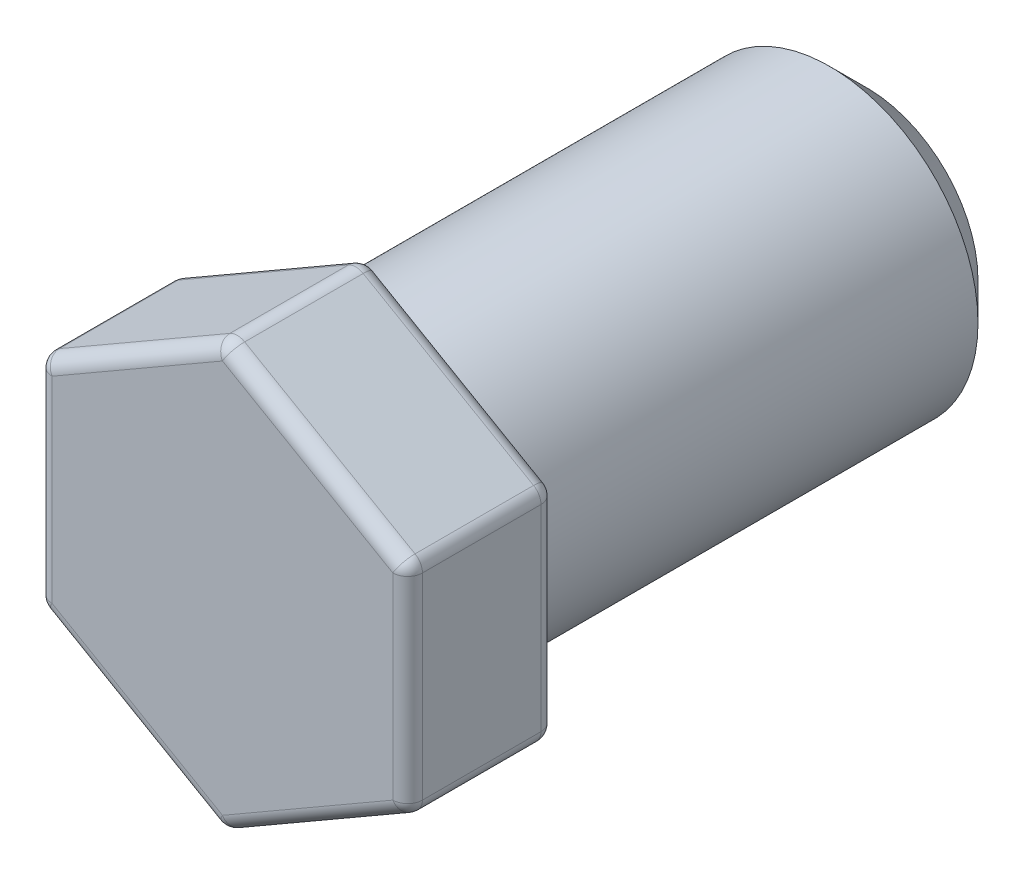
ISO-10303-21;
HEADER;
FILE_DESCRIPTION(('STEP AP214'),'2;1');
FILE_NAME('part.step','',(''),(''),'','','');
FILE_SCHEMA(('AUTOMOTIVE_DESIGN { 1 0 10303 214 1 1 1 1 }'));
ENDSEC;
DATA;
#1=APPLICATION_CONTEXT('core data for automotive mechanical design processes');
#2=APPLICATION_PROTOCOL_DEFINITION('international standard','automotive_design',2000,#1);
#3=PRODUCT_CONTEXT('',#1,'mechanical');
#4=PRODUCT('Part','Part','',(#3));
#5=PRODUCT_RELATED_PRODUCT_CATEGORY('part','',(#4));
#6=PRODUCT_DEFINITION_FORMATION('','',#4);
#7=PRODUCT_DEFINITION_CONTEXT('part definition',#1,'design');
#8=PRODUCT_DEFINITION('design','',#6,#7);
#9=PRODUCT_DEFINITION_SHAPE('','',#8);
#10=(LENGTH_UNIT() NAMED_UNIT(*) SI_UNIT(.MILLI.,.METRE.));
#11=(NAMED_UNIT(*) PLANE_ANGLE_UNIT() SI_UNIT($,.RADIAN.));
#12=(NAMED_UNIT(*) SI_UNIT($,.STERADIAN.) SOLID_ANGLE_UNIT());
#13=UNCERTAINTY_MEASURE_WITH_UNIT(LENGTH_MEASURE(1.E-05),#10,'distance_accuracy_value','');
#14=(GEOMETRIC_REPRESENTATION_CONTEXT(3) GLOBAL_UNCERTAINTY_ASSIGNED_CONTEXT((#13)) GLOBAL_UNIT_ASSIGNED_CONTEXT((#10,
#11,#12)) REPRESENTATION_CONTEXT('',''));
#15=CARTESIAN_POINT('',(0.,0.,0.));
#16=DIRECTION('',(0.,0.,1.));
#17=DIRECTION('',(1.,0.,0.));
#18=AXIS2_PLACEMENT_3D('',#15,#16,#17);
#19=CARTESIAN_POINT('',(0.,0.,3.35));
#20=DIRECTION('',(0.,0.,-1.));
#21=DIRECTION('',(-1.,0.,0.));
#22=AXIS2_PLACEMENT_3D('',#19,#20,#21);
#23=CYLINDRICAL_SURFACE('',#22,2.);
#24=CARTESIAN_POINT('',(0.,0.,-2.85));
#25=DIRECTION('',(0.,0.,1.));
#26=DIRECTION('',(1.,0.,0.));
#27=AXIS2_PLACEMENT_3D('',#24,#25,#26);
#28=CIRCLE('',#27,2.);
#29=CARTESIAN_POINT('',(2.,0.,-2.85));
#30=VERTEX_POINT('',#29);
#31=EDGE_CURVE('E56',#30,#30,#28,.T.);
#32=ORIENTED_EDGE('',*,*,#31,.T.);
#33=EDGE_LOOP('',(#32));
#34=FACE_BOUND('',#33,.T.);
#35=CARTESIAN_POINT('',(0.,0.,3.15));
#36=DIRECTION('',(0.,0.,1.));
#37=DIRECTION('',(1.,0.,0.));
#38=AXIS2_PLACEMENT_3D('',#35,#36,#37);
#39=CIRCLE('',#38,2.);
#40=CARTESIAN_POINT('',(2.,0.,3.15));
#41=VERTEX_POINT('',#40);
#42=EDGE_CURVE('E273',#41,#41,#39,.F.);
#43=ORIENTED_EDGE('',*,*,#42,.T.);
#44=EDGE_LOOP('',(#43));
#45=FACE_BOUND('',#44,.T.);
#46=ADVANCED_FACE('F47',(#34,#45),#23,.T.);
#47=CARTESIAN_POINT('',(0.,0.,-3.35));
#48=DIRECTION('',(0.,0.,1.));
#49=DIRECTION('',(1.,0.,0.));
#50=AXIS2_PLACEMENT_3D('',#47,#48,#49);
#51=PLANE('',#50);
#52=CARTESIAN_POINT('',(0.,0.,-3.35));
#53=DIRECTION('',(0.,0.,1.));
#54=DIRECTION('',(1.,0.,0.));
#55=AXIS2_PLACEMENT_3D('',#52,#53,#54);
#56=CIRCLE('',#55,1.5);
#57=CARTESIAN_POINT('',(1.5,0.,-3.35));
#58=VERTEX_POINT('',#57);
#59=EDGE_CURVE('E11',#58,#58,#56,.F.);
#60=ORIENTED_EDGE('',*,*,#59,.T.);
#61=EDGE_LOOP('',(#60));
#62=FACE_BOUND('',#61,.T.);
#63=ADVANCED_FACE('F388',(#62),#51,.F.);
#64=CARTESIAN_POINT('',(-2.5,-1.44337567297406,5.35));
#65=DIRECTION('',(0.5,0.866025403784439,0.));
#66=DIRECTION('',(-0.866025403784439,0.5,0.));
#67=AXIS2_PLACEMENT_3D('',#64,#65,#66);
#68=PLANE('',#67);
#69=DIRECTION('',(0.866025403784439,-0.5,0.));
#70=VECTOR('',#69,1.);
#71=CARTESIAN_POINT('',(-2.5,-1.44337567297406,5.15));
#72=LINE('',#71,#70);
#73=CARTESIAN_POINT('',(-0.1,-2.82901631902917,5.15));
#74=VERTEX_POINT('',#73);
#75=CARTESIAN_POINT('',(-2.4,-1.50111069989303,5.15));
#76=VERTEX_POINT('',#75);
#77=EDGE_CURVE('E250',#74,#76,#72,.F.);
#78=ORIENTED_EDGE('',*,*,#77,.T.);
#79=DIRECTION('',(0.,0.,-1.));
#80=VECTOR('',#79,1.);
#81=CARTESIAN_POINT('',(-2.4,-1.50111069989303,5.35));
#82=LINE('',#81,#80);
#83=CARTESIAN_POINT('',(-2.4,-1.50111069989303,3.55));
#84=VERTEX_POINT('',#83);
#85=EDGE_CURVE('E321',#76,#84,#82,.T.);
#86=ORIENTED_EDGE('',*,*,#85,.T.);
#87=DIRECTION('',(0.866025403784439,-0.5,0.));
#88=VECTOR('',#87,1.);
#89=CARTESIAN_POINT('',(-2.5,-1.44337567297406,3.55));
#90=LINE('',#89,#88);
#91=CARTESIAN_POINT('',(-0.1,-2.82901631902917,3.55));
#92=VERTEX_POINT('',#91);
#93=EDGE_CURVE('E247',#84,#92,#90,.T.);
#94=ORIENTED_EDGE('',*,*,#93,.T.);
#95=DIRECTION('',(0.,0.,-1.));
#96=VECTOR('',#95,1.);
#97=CARTESIAN_POINT('',(-0.1,-2.82901631902917,5.35));
#98=LINE('',#97,#96);
#99=EDGE_CURVE('E319',#92,#74,#98,.F.);
#100=ORIENTED_EDGE('',*,*,#99,.T.);
#101=EDGE_LOOP('',(#78,#86,#94,#100));
#102=FACE_BOUND('',#101,.T.);
#103=ADVANCED_FACE('F393',(#102),#68,.F.);
#104=CARTESIAN_POINT('',(0.,-2.88675134594813,5.35));
#105=DIRECTION('',(-0.5,0.866025403784438,0.));
#106=DIRECTION('',(-0.866025403784439,-0.5,0.));
#107=AXIS2_PLACEMENT_3D('',#104,#105,#106);
#108=PLANE('',#107);
#109=DIRECTION('',(0.866025403784439,0.5,0.));
#110=VECTOR('',#109,1.);
#111=CARTESIAN_POINT('',(0.,-2.88675134594813,3.55));
#112=LINE('',#111,#110);
#113=CARTESIAN_POINT('',(0.1,-2.82901631902917,3.55));
#114=VERTEX_POINT('',#113);
#115=CARTESIAN_POINT('',(2.4,-1.50111069989303,3.55));
#116=VERTEX_POINT('',#115);
#117=EDGE_CURVE('E241',#114,#116,#112,.T.);
#118=ORIENTED_EDGE('',*,*,#117,.T.);
#119=DIRECTION('',(0.,0.,-1.));
#120=VECTOR('',#119,1.);
#121=CARTESIAN_POINT('',(2.4,-1.50111069989303,5.35));
#122=LINE('',#121,#120);
#123=CARTESIAN_POINT('',(2.4,-1.50111069989303,5.15));
#124=VERTEX_POINT('',#123);
#125=EDGE_CURVE('E340',#116,#124,#122,.F.);
#126=ORIENTED_EDGE('',*,*,#125,.T.);
#127=DIRECTION('',(0.866025403784439,0.5,0.));
#128=VECTOR('',#127,1.);
#129=CARTESIAN_POINT('',(0.,-2.88675134594813,5.15));
#130=LINE('',#129,#128);
#131=CARTESIAN_POINT('',(0.1,-2.82901631902917,5.15));
#132=VERTEX_POINT('',#131);
#133=EDGE_CURVE('E244',#124,#132,#130,.F.);
#134=ORIENTED_EDGE('',*,*,#133,.T.);
#135=DIRECTION('',(0.,0.,-1.));
#136=VECTOR('',#135,1.);
#137=CARTESIAN_POINT('',(0.0999999999999999,-2.82901631902917,5.35));
#138=LINE('',#137,#136);
#139=EDGE_CURVE('E338',#132,#114,#138,.T.);
#140=ORIENTED_EDGE('',*,*,#139,.T.);
#141=EDGE_LOOP('',(#118,#126,#134,#140));
#142=FACE_BOUND('',#141,.T.);
#143=ADVANCED_FACE('F572',(#142),#108,.F.);
#144=CARTESIAN_POINT('',(2.5,-1.44337567297406,5.35));
#145=DIRECTION('',(-1.,0.,0.));
#146=DIRECTION('',(0.,-1.,0.));
#147=AXIS2_PLACEMENT_3D('',#144,#145,#146);
#148=PLANE('',#147);
#149=DIRECTION('',(0.,1.,0.));
#150=VECTOR('',#149,1.);
#151=CARTESIAN_POINT('',(2.5,-1.44337567297406,5.15));
#152=LINE('',#151,#150);
#153=CARTESIAN_POINT('',(2.5,1.32790561913614,5.15));
#154=VERTEX_POINT('',#153);
#155=CARTESIAN_POINT('',(2.5,-1.32790561913614,5.15));
#156=VERTEX_POINT('',#155);
#157=EDGE_CURVE('E239',#154,#156,#152,.F.);
#158=ORIENTED_EDGE('',*,*,#157,.T.);
#159=DIRECTION('',(0.,0.,-1.));
#160=VECTOR('',#159,1.);
#161=CARTESIAN_POINT('',(2.5,-1.32790561913614,5.35));
#162=LINE('',#161,#160);
#163=CARTESIAN_POINT('',(2.5,-1.32790561913614,3.55));
#164=VERTEX_POINT('',#163);
#165=EDGE_CURVE('E70',#156,#164,#162,.T.);
#166=ORIENTED_EDGE('',*,*,#165,.T.);
#167=DIRECTION('',(0.,1.,0.));
#168=VECTOR('',#167,1.);
#169=CARTESIAN_POINT('',(2.5,-1.44337567297406,3.55));
#170=LINE('',#169,#168);
#171=CARTESIAN_POINT('',(2.5,1.32790561913614,3.55));
#172=VERTEX_POINT('',#171);
#173=EDGE_CURVE('E237',#164,#172,#170,.T.);
#174=ORIENTED_EDGE('',*,*,#173,.T.);
#175=DIRECTION('',(0.,0.,-1.));
#176=VECTOR('',#175,1.);
#177=CARTESIAN_POINT('',(2.5,1.32790561913614,5.35));
#178=LINE('',#177,#176);
#179=EDGE_CURVE('E335',#172,#154,#178,.F.);
#180=ORIENTED_EDGE('',*,*,#179,.T.);
#181=EDGE_LOOP('',(#158,#166,#174,#180));
#182=FACE_BOUND('',#181,.T.);
#183=ADVANCED_FACE('F517',(#182),#148,.F.);
#184=CARTESIAN_POINT('',(2.5,1.44337567297406,5.35));
#185=DIRECTION('',(-0.5,-0.866025403784439,0.));
#186=DIRECTION('',(0.866025403784439,-0.5,0.));
#187=AXIS2_PLACEMENT_3D('',#184,#185,#186);
#188=PLANE('',#187);
#189=DIRECTION('',(-0.866025403784439,0.5,0.));
#190=VECTOR('',#189,1.);
#191=CARTESIAN_POINT('',(2.5,1.44337567297406,3.55));
#192=LINE('',#191,#190);
#193=CARTESIAN_POINT('',(2.4,1.50111069989303,3.55));
#194=VERTEX_POINT('',#193);
#195=CARTESIAN_POINT('',(0.0999999999999994,2.82901631902917,3.55));
#196=VERTEX_POINT('',#195);
#197=EDGE_CURVE('E231',#194,#196,#192,.T.);
#198=ORIENTED_EDGE('',*,*,#197,.T.);
#199=DIRECTION('',(0.,0.,-1.));
#200=VECTOR('',#199,1.);
#201=CARTESIAN_POINT('',(0.1,2.82901631902917,5.35));
#202=LINE('',#201,#200);
#203=CARTESIAN_POINT('',(0.0999999999999994,2.82901631902917,5.15));
#204=VERTEX_POINT('',#203);
#205=EDGE_CURVE('E333',#196,#204,#202,.F.);
#206=ORIENTED_EDGE('',*,*,#205,.T.);
#207=DIRECTION('',(-0.866025403784439,0.5,0.));
#208=VECTOR('',#207,1.);
#209=CARTESIAN_POINT('',(2.5,1.44337567297406,5.15));
#210=LINE('',#209,#208);
#211=CARTESIAN_POINT('',(2.4,1.50111069989303,5.15));
#212=VERTEX_POINT('',#211);
#213=EDGE_CURVE('E234',#204,#212,#210,.F.);
#214=ORIENTED_EDGE('',*,*,#213,.T.);
#215=DIRECTION('',(0.,0.,-1.));
#216=VECTOR('',#215,1.);
#217=CARTESIAN_POINT('',(2.4,1.50111069989303,5.35));
#218=LINE('',#217,#216);
#219=EDGE_CURVE('E331',#212,#194,#218,.T.);
#220=ORIENTED_EDGE('',*,*,#219,.T.);
#221=EDGE_LOOP('',(#198,#206,#214,#220));
#222=FACE_BOUND('',#221,.T.);
#223=ADVANCED_FACE('F526',(#222),#188,.F.);
#224=CARTESIAN_POINT('',(0.,2.88675134594813,5.35));
#225=DIRECTION('',(0.5,-0.866025403784439,0.));
#226=DIRECTION('',(0.866025403784439,0.5,0.));
#227=AXIS2_PLACEMENT_3D('',#224,#225,#226);
#228=PLANE('',#227);
#229=DIRECTION('',(-0.866025403784439,-0.5,0.));
#230=VECTOR('',#229,1.);
#231=CARTESIAN_POINT('',(0.,2.88675134594813,3.55));
#232=LINE('',#231,#230);
#233=CARTESIAN_POINT('',(-0.0999999999999994,2.82901631902917,3.55));
#234=VERTEX_POINT('',#233);
#235=CARTESIAN_POINT('',(-2.4,1.50111069989303,3.55));
#236=VERTEX_POINT('',#235);
#237=EDGE_CURVE('E225',#234,#236,#232,.T.);
#238=ORIENTED_EDGE('',*,*,#237,.T.);
#239=DIRECTION('',(0.,0.,-1.));
#240=VECTOR('',#239,1.);
#241=CARTESIAN_POINT('',(-2.4,1.50111069989303,5.35));
#242=LINE('',#241,#240);
#243=CARTESIAN_POINT('',(-2.4,1.50111069989303,5.15));
#244=VERTEX_POINT('',#243);
#245=EDGE_CURVE('E329',#236,#244,#242,.F.);
#246=ORIENTED_EDGE('',*,*,#245,.T.);
#247=DIRECTION('',(-0.866025403784439,-0.5,0.));
#248=VECTOR('',#247,1.);
#249=CARTESIAN_POINT('',(0.,2.88675134594813,5.15));
#250=LINE('',#249,#248);
#251=CARTESIAN_POINT('',(-0.0999999999999995,2.82901631902917,5.15));
#252=VERTEX_POINT('',#251);
#253=EDGE_CURVE('E228',#244,#252,#250,.F.);
#254=ORIENTED_EDGE('',*,*,#253,.T.);
#255=DIRECTION('',(0.,0.,-1.));
#256=VECTOR('',#255,1.);
#257=CARTESIAN_POINT('',(-0.0999999999999995,2.82901631902917,5.35));
#258=LINE('',#257,#256);
#259=EDGE_CURVE('E327',#252,#234,#258,.T.);
#260=ORIENTED_EDGE('',*,*,#259,.T.);
#261=EDGE_LOOP('',(#238,#246,#254,#260));
#262=FACE_BOUND('',#261,.T.);
#263=ADVANCED_FACE('F590',(#262),#228,.F.);
#264=CARTESIAN_POINT('',(-2.5,1.44337567297406,5.35));
#265=DIRECTION('',(1.,0.,0.));
#266=DIRECTION('',(0.,1.,0.));
#267=AXIS2_PLACEMENT_3D('',#264,#265,#266);
#268=PLANE('',#267);
#269=DIRECTION('',(0.,-1.,0.));
#270=VECTOR('',#269,1.);
#271=CARTESIAN_POINT('',(-2.5,1.44337567297406,3.55));
#272=LINE('',#271,#270);
#273=CARTESIAN_POINT('',(-2.5,1.32790561913614,3.55));
#274=VERTEX_POINT('',#273);
#275=CARTESIAN_POINT('',(-2.5,-1.32790561913614,3.55));
#276=VERTEX_POINT('',#275);
#277=EDGE_CURVE('E216',#274,#276,#272,.T.);
#278=ORIENTED_EDGE('',*,*,#277,.T.);
#279=DIRECTION('',(0.,0.,-1.));
#280=VECTOR('',#279,1.);
#281=CARTESIAN_POINT('',(-2.5,-1.32790561913614,5.35));
#282=LINE('',#281,#280);
#283=CARTESIAN_POINT('',(-2.5,-1.32790561913614,5.15));
#284=VERTEX_POINT('',#283);
#285=EDGE_CURVE('E325',#276,#284,#282,.F.);
#286=ORIENTED_EDGE('',*,*,#285,.T.);
#287=DIRECTION('',(0.,-1.,0.));
#288=VECTOR('',#287,1.);
#289=CARTESIAN_POINT('',(-2.5,1.44337567297406,5.15));
#290=LINE('',#289,#288);
#291=CARTESIAN_POINT('',(-2.5,1.32790561913614,5.15));
#292=VERTEX_POINT('',#291);
#293=EDGE_CURVE('E197',#284,#292,#290,.F.);
#294=ORIENTED_EDGE('',*,*,#293,.T.);
#295=DIRECTION('',(0.,0.,-1.));
#296=VECTOR('',#295,1.);
#297=CARTESIAN_POINT('',(-2.5,1.32790561913614,5.35));
#298=LINE('',#297,#296);
#299=EDGE_CURVE('E323',#292,#274,#298,.T.);
#300=ORIENTED_EDGE('',*,*,#299,.T.);
#301=EDGE_LOOP('',(#278,#286,#294,#300));
#302=FACE_BOUND('',#301,.T.);
#303=ADVANCED_FACE('F542',(#302),#268,.F.);
#304=CARTESIAN_POINT('',(0.,0.,5.35));
#305=DIRECTION('',(0.,0.,1.));
#306=DIRECTION('',(1.,0.,0.));
#307=AXIS2_PLACEMENT_3D('',#304,#305,#306);
#308=PLANE('',#307);
#309=DIRECTION('',(-0.866025403784439,-0.5,0.));
#310=VECTOR('',#309,1.);
#311=CARTESIAN_POINT('',(-2.4,1.27017059221718,5.35));
#312=LINE('',#311,#310);
#313=CARTESIAN_POINT('',(0.,2.65581123827228,5.35));
#314=VERTEX_POINT('',#313);
#315=CARTESIAN_POINT('',(-2.3,1.32790561913614,5.35));
#316=VERTEX_POINT('',#315);
#317=EDGE_CURVE('E215',#314,#316,#312,.T.);
#318=ORIENTED_EDGE('',*,*,#317,.T.);
#319=DIRECTION('',(0.,-1.,0.));
#320=VECTOR('',#319,1.);
#321=CARTESIAN_POINT('',(-2.3,-1.44337567297406,5.35));
#322=LINE('',#321,#320);
#323=CARTESIAN_POINT('',(-2.3,-1.32790561913614,5.35));
#324=VERTEX_POINT('',#323);
#325=EDGE_CURVE('E194',#316,#324,#322,.T.);
#326=ORIENTED_EDGE('',*,*,#325,.T.);
#327=DIRECTION('',(0.866025403784439,-0.5,0.));
#328=VECTOR('',#327,1.);
#329=CARTESIAN_POINT('',(0.0999999999999996,-2.71354626519124,5.35));
#330=LINE('',#329,#328);
#331=CARTESIAN_POINT('',(0.,-2.65581123827228,5.35));
#332=VERTEX_POINT('',#331);
#333=EDGE_CURVE('E202',#324,#332,#330,.T.);
#334=ORIENTED_EDGE('',*,*,#333,.T.);
#335=DIRECTION('',(0.866025403784439,0.5,0.));
#336=VECTOR('',#335,1.);
#337=CARTESIAN_POINT('',(2.4,-1.27017059221718,5.35));
#338=LINE('',#337,#336);
#339=CARTESIAN_POINT('',(2.3,-1.32790561913614,5.35));
#340=VERTEX_POINT('',#339);
#341=EDGE_CURVE('E208',#332,#340,#338,.T.);
#342=ORIENTED_EDGE('',*,*,#341,.T.);
#343=DIRECTION('',(0.,1.,0.));
#344=VECTOR('',#343,1.);
#345=CARTESIAN_POINT('',(2.3,1.44337567297406,5.35));
#346=LINE('',#345,#344);
#347=CARTESIAN_POINT('',(2.3,1.32790561913614,5.35));
#348=VERTEX_POINT('',#347);
#349=EDGE_CURVE('E533',#340,#348,#346,.T.);
#350=ORIENTED_EDGE('',*,*,#349,.T.);
#351=DIRECTION('',(-0.866025403784439,0.5,0.));
#352=VECTOR('',#351,1.);
#353=CARTESIAN_POINT('',(-0.1,2.71354626519124,5.35));
#354=LINE('',#353,#352);
#355=EDGE_CURVE('E220',#348,#314,#354,.T.);
#356=ORIENTED_EDGE('',*,*,#355,.T.);
#357=EDGE_LOOP('',(#318,#326,#334,#342,#350,#356));
#358=FACE_BOUND('',#357,.T.);
#359=ADVANCED_FACE('F212',(#358),#308,.T.);
#360=CARTESIAN_POINT('',(0.,0.,3.35));
#361=DIRECTION('',(0.,0.,1.));
#362=DIRECTION('',(1.,0.,0.));
#363=AXIS2_PLACEMENT_3D('',#360,#361,#362);
#364=PLANE('',#363);
#365=DIRECTION('',(0.,1.,0.));
#366=VECTOR('',#365,1.);
#367=CARTESIAN_POINT('',(2.3,0.,3.35));
#368=LINE('',#367,#366);
#369=CARTESIAN_POINT('',(2.3,1.32790561913614,3.35));
#370=VERTEX_POINT('',#369);
#371=CARTESIAN_POINT('',(2.3,-1.32790561913614,3.35));
#372=VERTEX_POINT('',#371);
#373=EDGE_CURVE('E267',#370,#372,#368,.F.);
#374=ORIENTED_EDGE('',*,*,#373,.T.);
#375=DIRECTION('',(0.866025403784439,0.5,0.));
#376=VECTOR('',#375,1.);
#377=CARTESIAN_POINT('',(1.15,-1.99185842870421,3.35));
#378=LINE('',#377,#376);
#379=CARTESIAN_POINT('',(0.,-2.65581123827228,3.35));
#380=VERTEX_POINT('',#379);
#381=EDGE_CURVE('E270',#372,#380,#378,.F.);
#382=ORIENTED_EDGE('',*,*,#381,.T.);
#383=DIRECTION('',(0.866025403784439,-0.5,0.));
#384=VECTOR('',#383,1.);
#385=CARTESIAN_POINT('',(-1.15,-1.99185842870421,3.35));
#386=LINE('',#385,#384);
#387=CARTESIAN_POINT('',(-2.3,-1.32790561913614,3.35));
#388=VERTEX_POINT('',#387);
#389=EDGE_CURVE('E255',#380,#388,#386,.F.);
#390=ORIENTED_EDGE('',*,*,#389,.T.);
#391=DIRECTION('',(0.,-1.,0.));
#392=VECTOR('',#391,1.);
#393=CARTESIAN_POINT('',(-2.3,0.,3.35));
#394=LINE('',#393,#392);
#395=CARTESIAN_POINT('',(-2.3,1.32790561913614,3.35));
#396=VERTEX_POINT('',#395);
#397=EDGE_CURVE('E258',#388,#396,#394,.F.);
#398=ORIENTED_EDGE('',*,*,#397,.T.);
#399=DIRECTION('',(-0.866025403784439,-0.5,0.));
#400=VECTOR('',#399,1.);
#401=CARTESIAN_POINT('',(-1.15,1.99185842870421,3.35));
#402=LINE('',#401,#400);
#403=CARTESIAN_POINT('',(0.,2.65581123827228,3.35));
#404=VERTEX_POINT('',#403);
#405=EDGE_CURVE('E261',#396,#404,#402,.F.);
#406=ORIENTED_EDGE('',*,*,#405,.T.);
#407=DIRECTION('',(-0.866025403784439,0.5,0.));
#408=VECTOR('',#407,1.);
#409=CARTESIAN_POINT('',(1.15,1.99185842870421,3.35));
#410=LINE('',#409,#408);
#411=EDGE_CURVE('E264',#404,#370,#410,.F.);
#412=ORIENTED_EDGE('',*,*,#411,.T.);
#413=EDGE_LOOP('',(#374,#382,#390,#398,#406,#412));
#414=FACE_BOUND('',#413,.T.);
#415=CARTESIAN_POINT('',(0.,0.,3.35));
#416=DIRECTION('',(0.,0.,1.));
#417=DIRECTION('',(1.,0.,0.));
#418=AXIS2_PLACEMENT_3D('',#415,#416,#417);
#419=CIRCLE('',#418,2.2);
#420=CARTESIAN_POINT('',(2.2,0.,3.35));
#421=VERTEX_POINT('',#420);
#422=EDGE_CURVE('E252',#421,#421,#419,.T.);
#423=ORIENTED_EDGE('',*,*,#422,.T.);
#424=EDGE_LOOP('',(#423));
#425=FACE_BOUND('',#424,.T.);
#426=ADVANCED_FACE('F418',(#414,#425),#364,.F.);
#427=CARTESIAN_POINT('',(2.3,0.,5.15));
#428=DIRECTION('',(0.,-1.,0.));
#429=DIRECTION('',(1.,0.,0.));
#430=AXIS2_PLACEMENT_3D('',#427,#428,#429);
#431=CYLINDRICAL_SURFACE('',#430,0.2);
#432=ORIENTED_EDGE('',*,*,#349,.F.);
#433=CARTESIAN_POINT('',(2.3,-1.32790561913614,5.15));
#434=DIRECTION('',(0.,-1.,0.));
#435=DIRECTION('',(1.,0.,0.));
#436=AXIS2_PLACEMENT_3D('',#433,#434,#435);
#437=CIRCLE('',#436,0.2);
#438=EDGE_CURVE('E310',#340,#156,#437,.F.);
#439=ORIENTED_EDGE('',*,*,#438,.T.);
#440=ORIENTED_EDGE('',*,*,#157,.F.);
#441=CARTESIAN_POINT('',(2.3,1.32790561913614,5.15));
#442=DIRECTION('',(0.,-1.,0.));
#443=DIRECTION('',(1.,0.,0.));
#444=AXIS2_PLACEMENT_3D('',#441,#442,#443);
#445=CIRCLE('',#444,0.2);
#446=EDGE_CURVE('E308',#154,#348,#445,.T.);
#447=ORIENTED_EDGE('',*,*,#446,.T.);
#448=EDGE_LOOP('',(#432,#439,#440,#447));
#449=FACE_BOUND('',#448,.T.);
#450=ADVANCED_FACE('F414',(#449),#431,.T.);
#451=CARTESIAN_POINT('',(1.15,1.99185842870421,5.15));
#452=DIRECTION('',(0.866025403784439,-0.5,0.));
#453=DIRECTION('',(0.5,0.866025403784439,0.));
#454=AXIS2_PLACEMENT_3D('',#451,#452,#453);
#455=CYLINDRICAL_SURFACE('',#454,0.2);
#456=ORIENTED_EDGE('',*,*,#213,.F.);
#457=CARTESIAN_POINT('',(0.,2.65581123827228,5.15));
#458=DIRECTION('',(0.866025403784439,-0.5,0.));
#459=DIRECTION('',(0.5,0.866025403784439,0.));
#460=AXIS2_PLACEMENT_3D('',#457,#458,#459);
#461=CIRCLE('',#460,0.2);
#462=EDGE_CURVE('E297',#204,#314,#461,.T.);
#463=ORIENTED_EDGE('',*,*,#462,.T.);
#464=ORIENTED_EDGE('',*,*,#355,.F.);
#465=CARTESIAN_POINT('',(2.3,1.32790561913614,5.15));
#466=DIRECTION('',(0.866025403784439,-0.5,0.));
#467=DIRECTION('',(0.5,0.866025403784439,0.));
#468=AXIS2_PLACEMENT_3D('',#465,#466,#467);
#469=CIRCLE('',#468,0.2);
#470=EDGE_CURVE('E294',#348,#212,#469,.F.);
#471=ORIENTED_EDGE('',*,*,#470,.T.);
#472=EDGE_LOOP('',(#456,#463,#464,#471));
#473=FACE_BOUND('',#472,.T.);
#474=ADVANCED_FACE('F410',(#473),#455,.T.);
#475=CARTESIAN_POINT('',(1.15,-1.99185842870421,5.15));
#476=DIRECTION('',(-0.866025403784439,-0.5,0.));
#477=DIRECTION('',(0.5,-0.866025403784438,0.));
#478=AXIS2_PLACEMENT_3D('',#475,#476,#477);
#479=CYLINDRICAL_SURFACE('',#478,0.2);
#480=ORIENTED_EDGE('',*,*,#133,.F.);
#481=CARTESIAN_POINT('',(2.3,-1.32790561913614,5.15));
#482=DIRECTION('',(-0.866025403784439,-0.5,0.));
#483=DIRECTION('',(0.5,-0.866025403784438,0.));
#484=AXIS2_PLACEMENT_3D('',#481,#482,#483);
#485=CIRCLE('',#484,0.2);
#486=EDGE_CURVE('E305',#124,#340,#485,.T.);
#487=ORIENTED_EDGE('',*,*,#486,.T.);
#488=ORIENTED_EDGE('',*,*,#341,.F.);
#489=CARTESIAN_POINT('',(0.,-2.65581123827228,5.15));
#490=DIRECTION('',(-0.866025403784439,-0.5,0.));
#491=DIRECTION('',(0.5,-0.866025403784438,0.));
#492=AXIS2_PLACEMENT_3D('',#489,#490,#491);
#493=CIRCLE('',#492,0.2);
#494=EDGE_CURVE('E303',#332,#132,#493,.F.);
#495=ORIENTED_EDGE('',*,*,#494,.T.);
#496=EDGE_LOOP('',(#480,#487,#488,#495));
#497=FACE_BOUND('',#496,.T.);
#498=ADVANCED_FACE('F406',(#497),#479,.T.);
#499=CARTESIAN_POINT('',(-1.15,1.99185842870421,5.15));
#500=DIRECTION('',(0.866025403784439,0.5,0.));
#501=DIRECTION('',(-0.5,0.866025403784439,0.));
#502=AXIS2_PLACEMENT_3D('',#499,#500,#501);
#503=CYLINDRICAL_SURFACE('',#502,0.2);
#504=ORIENTED_EDGE('',*,*,#253,.F.);
#505=CARTESIAN_POINT('',(-2.3,1.32790561913614,5.15));
#506=DIRECTION('',(0.866025403784439,0.5,0.));
#507=DIRECTION('',(-0.5,0.866025403784439,0.));
#508=AXIS2_PLACEMENT_3D('',#505,#506,#507);
#509=CIRCLE('',#508,0.2);
#510=EDGE_CURVE('E288',#244,#316,#509,.T.);
#511=ORIENTED_EDGE('',*,*,#510,.T.);
#512=ORIENTED_EDGE('',*,*,#317,.F.);
#513=CARTESIAN_POINT('',(0.,2.65581123827228,5.15));
#514=DIRECTION('',(0.866025403784439,0.5,0.));
#515=DIRECTION('',(-0.5,0.866025403784439,0.));
#516=AXIS2_PLACEMENT_3D('',#513,#514,#515);
#517=CIRCLE('',#516,0.2);
#518=EDGE_CURVE('E285',#314,#252,#517,.F.);
#519=ORIENTED_EDGE('',*,*,#518,.T.);
#520=EDGE_LOOP('',(#504,#511,#512,#519));
#521=FACE_BOUND('',#520,.T.);
#522=ADVANCED_FACE('F403',(#521),#503,.T.);
#523=CARTESIAN_POINT('',(-1.15,-1.99185842870421,5.15));
#524=DIRECTION('',(-0.866025403784439,0.5,0.));
#525=DIRECTION('',(-0.5,-0.866025403784439,0.));
#526=AXIS2_PLACEMENT_3D('',#523,#524,#525);
#527=CYLINDRICAL_SURFACE('',#526,0.2);
#528=ORIENTED_EDGE('',*,*,#333,.F.);
#529=CARTESIAN_POINT('',(-2.3,-1.32790561913614,5.15));
#530=DIRECTION('',(-0.866025403784439,0.5,0.));
#531=DIRECTION('',(-0.5,-0.866025403784439,0.));
#532=AXIS2_PLACEMENT_3D('',#529,#530,#531);
#533=CIRCLE('',#532,0.2);
#534=EDGE_CURVE('E175',#324,#76,#533,.F.);
#535=ORIENTED_EDGE('',*,*,#534,.T.);
#536=ORIENTED_EDGE('',*,*,#77,.F.);
#537=CARTESIAN_POINT('',(0.,-2.65581123827228,5.15));
#538=DIRECTION('',(-0.866025403784439,0.5,0.));
#539=DIRECTION('',(-0.5,-0.866025403784439,0.));
#540=AXIS2_PLACEMENT_3D('',#537,#538,#539);
#541=CIRCLE('',#540,0.2);
#542=EDGE_CURVE('E186',#74,#332,#541,.T.);
#543=ORIENTED_EDGE('',*,*,#542,.T.);
#544=EDGE_LOOP('',(#528,#535,#536,#543));
#545=FACE_BOUND('',#544,.T.);
#546=ADVANCED_FACE('F203',(#545),#527,.T.);
#547=CARTESIAN_POINT('',(-2.3,0.,5.15));
#548=DIRECTION('',(0.,1.,0.));
#549=DIRECTION('',(-1.,0.,0.));
#550=AXIS2_PLACEMENT_3D('',#547,#548,#549);
#551=CYLINDRICAL_SURFACE('',#550,0.2);
#552=ORIENTED_EDGE('',*,*,#293,.F.);
#553=CARTESIAN_POINT('',(-2.3,-1.32790561913614,5.15));
#554=DIRECTION('',(0.,1.,0.));
#555=DIRECTION('',(-1.,0.,0.));
#556=AXIS2_PLACEMENT_3D('',#553,#554,#555);
#557=CIRCLE('',#556,0.2);
#558=EDGE_CURVE('E178',#284,#324,#557,.T.);
#559=ORIENTED_EDGE('',*,*,#558,.T.);
#560=ORIENTED_EDGE('',*,*,#325,.F.);
#561=CARTESIAN_POINT('',(-2.3,1.32790561913614,5.15));
#562=DIRECTION('',(0.,1.,0.));
#563=DIRECTION('',(-1.,0.,0.));
#564=AXIS2_PLACEMENT_3D('',#561,#562,#563);
#565=CIRCLE('',#564,0.2);
#566=EDGE_CURVE('E198',#316,#292,#565,.F.);
#567=ORIENTED_EDGE('',*,*,#566,.T.);
#568=EDGE_LOOP('',(#552,#559,#560,#567));
#569=FACE_BOUND('',#568,.T.);
#570=ADVANCED_FACE('F191',(#569),#551,.T.);
#571=CARTESIAN_POINT('',(0.1,2.71354626519124,3.55));
#572=DIRECTION('',(-0.866025403784439,-0.5,0.));
#573=DIRECTION('',(0.5,-0.866025403784439,0.));
#574=AXIS2_PLACEMENT_3D('',#571,#572,#573);
#575=CYLINDRICAL_SURFACE('',#574,0.2);
#576=ORIENTED_EDGE('',*,*,#405,.F.);
#577=CARTESIAN_POINT('',(-2.3,1.32790561913614,3.55));
#578=DIRECTION('',(-0.866025403784439,-0.5,0.));
#579=DIRECTION('',(0.5,-0.866025403784439,0.));
#580=AXIS2_PLACEMENT_3D('',#577,#578,#579);
#581=CIRCLE('',#580,0.2);
#582=EDGE_CURVE('E292',#396,#236,#581,.F.);
#583=ORIENTED_EDGE('',*,*,#582,.T.);
#584=ORIENTED_EDGE('',*,*,#237,.F.);
#585=CARTESIAN_POINT('',(0.,2.65581123827228,3.55));
#586=DIRECTION('',(-0.866025403784439,-0.5,0.));
#587=DIRECTION('',(0.5,-0.866025403784439,0.));
#588=AXIS2_PLACEMENT_3D('',#585,#586,#587);
#589=CIRCLE('',#588,0.2);
#590=EDGE_CURVE('E290',#234,#404,#589,.T.);
#591=ORIENTED_EDGE('',*,*,#590,.T.);
#592=EDGE_LOOP('',(#576,#583,#584,#591));
#593=FACE_BOUND('',#592,.T.);
#594=ADVANCED_FACE('F400',(#593),#575,.T.);
#595=CARTESIAN_POINT('',(-2.3,1.44337567297406,3.55));
#596=DIRECTION('',(0.,-1.,0.));
#597=DIRECTION('',(1.,0.,0.));
#598=AXIS2_PLACEMENT_3D('',#595,#596,#597);
#599=CYLINDRICAL_SURFACE('',#598,0.2);
#600=ORIENTED_EDGE('',*,*,#397,.F.);
#601=CARTESIAN_POINT('',(-2.3,-1.32790561913614,3.55));
#602=DIRECTION('',(0.,-1.,0.));
#603=DIRECTION('',(1.,0.,0.));
#604=AXIS2_PLACEMENT_3D('',#601,#602,#603);
#605=CIRCLE('',#604,0.2);
#606=EDGE_CURVE('E283',#388,#276,#605,.F.);
#607=ORIENTED_EDGE('',*,*,#606,.T.);
#608=ORIENTED_EDGE('',*,*,#277,.F.);
#609=CARTESIAN_POINT('',(-2.3,1.32790561913614,3.55));
#610=DIRECTION('',(0.,-1.,0.));
#611=DIRECTION('',(1.,0.,0.));
#612=AXIS2_PLACEMENT_3D('',#609,#610,#611);
#613=CIRCLE('',#612,0.2);
#614=EDGE_CURVE('E281',#274,#396,#613,.T.);
#615=ORIENTED_EDGE('',*,*,#614,.T.);
#616=EDGE_LOOP('',(#600,#607,#608,#615));
#617=FACE_BOUND('',#616,.T.);
#618=ADVANCED_FACE('F435',(#617),#599,.T.);
#619=CARTESIAN_POINT('',(2.4,1.27017059221718,3.55));
#620=DIRECTION('',(-0.866025403784439,0.5,0.));
#621=DIRECTION('',(-0.5,-0.866025403784439,0.));
#622=AXIS2_PLACEMENT_3D('',#619,#620,#621);
#623=CYLINDRICAL_SURFACE('',#622,0.2);
#624=ORIENTED_EDGE('',*,*,#411,.F.);
#625=CARTESIAN_POINT('',(0.,2.65581123827228,3.55));
#626=DIRECTION('',(-0.866025403784439,0.5,0.));
#627=DIRECTION('',(-0.5,-0.866025403784439,0.));
#628=AXIS2_PLACEMENT_3D('',#625,#626,#627);
#629=CIRCLE('',#628,0.2);
#630=EDGE_CURVE('E301',#404,#196,#629,.F.);
#631=ORIENTED_EDGE('',*,*,#630,.T.);
#632=ORIENTED_EDGE('',*,*,#197,.F.);
#633=CARTESIAN_POINT('',(2.3,1.32790561913614,3.55));
#634=DIRECTION('',(-0.866025403784439,0.5,0.));
#635=DIRECTION('',(-0.5,-0.866025403784439,0.));
#636=AXIS2_PLACEMENT_3D('',#633,#634,#635);
#637=CIRCLE('',#636,0.2);
#638=EDGE_CURVE('E299',#194,#370,#637,.T.);
#639=ORIENTED_EDGE('',*,*,#638,.T.);
#640=EDGE_LOOP('',(#624,#631,#632,#639));
#641=FACE_BOUND('',#640,.T.);
#642=ADVANCED_FACE('F431',(#641),#623,.T.);
#643=CARTESIAN_POINT('',(-2.4,-1.27017059221718,3.55));
#644=DIRECTION('',(0.866025403784439,-0.5,0.));
#645=DIRECTION('',(0.5,0.866025403784439,0.));
#646=AXIS2_PLACEMENT_3D('',#643,#644,#645);
#647=CYLINDRICAL_SURFACE('',#646,0.2);
#648=ORIENTED_EDGE('',*,*,#93,.F.);
#649=CARTESIAN_POINT('',(-2.3,-1.32790561913614,3.55));
#650=DIRECTION('',(0.866025403784439,-0.5,0.));
#651=DIRECTION('',(0.5,0.866025403784439,0.));
#652=AXIS2_PLACEMENT_3D('',#649,#650,#651);
#653=CIRCLE('',#652,0.2);
#654=EDGE_CURVE('E279',#84,#388,#653,.T.);
#655=ORIENTED_EDGE('',*,*,#654,.T.);
#656=ORIENTED_EDGE('',*,*,#389,.F.);
#657=CARTESIAN_POINT('',(0.,-2.65581123827228,3.55));
#658=DIRECTION('',(0.866025403784439,-0.5,0.));
#659=DIRECTION('',(0.5,0.866025403784439,0.));
#660=AXIS2_PLACEMENT_3D('',#657,#658,#659);
#661=CIRCLE('',#660,0.2);
#662=EDGE_CURVE('E185',#380,#92,#661,.F.);
#663=ORIENTED_EDGE('',*,*,#662,.T.);
#664=EDGE_LOOP('',(#648,#655,#656,#663));
#665=FACE_BOUND('',#664,.T.);
#666=ADVANCED_FACE('F428',(#665),#647,.T.);
#667=CARTESIAN_POINT('',(2.3,-1.44337567297406,3.55));
#668=DIRECTION('',(0.,1.,0.));
#669=DIRECTION('',(-1.,0.,0.));
#670=AXIS2_PLACEMENT_3D('',#667,#668,#669);
#671=CYLINDRICAL_SURFACE('',#670,0.2);
#672=ORIENTED_EDGE('',*,*,#173,.F.);
#673=CARTESIAN_POINT('',(2.3,-1.32790561913614,3.55));
#674=DIRECTION('',(0.,1.,0.));
#675=DIRECTION('',(-1.,0.,0.));
#676=AXIS2_PLACEMENT_3D('',#673,#674,#675);
#677=CIRCLE('',#676,0.2);
#678=EDGE_CURVE('E317',#164,#372,#677,.T.);
#679=ORIENTED_EDGE('',*,*,#678,.T.);
#680=ORIENTED_EDGE('',*,*,#373,.F.);
#681=CARTESIAN_POINT('',(2.3,1.32790561913614,3.55));
#682=DIRECTION('',(0.,1.,0.));
#683=DIRECTION('',(-1.,0.,0.));
#684=AXIS2_PLACEMENT_3D('',#681,#682,#683);
#685=CIRCLE('',#684,0.2);
#686=EDGE_CURVE('E63',#370,#172,#685,.F.);
#687=ORIENTED_EDGE('',*,*,#686,.T.);
#688=EDGE_LOOP('',(#672,#679,#680,#687));
#689=FACE_BOUND('',#688,.T.);
#690=ADVANCED_FACE('F424',(#689),#671,.T.);
#691=CARTESIAN_POINT('',(-0.1,-2.71354626519124,3.55));
#692=DIRECTION('',(0.866025403784439,0.5,0.));
#693=DIRECTION('',(-0.5,0.866025403784438,0.));
#694=AXIS2_PLACEMENT_3D('',#691,#692,#693);
#695=CYLINDRICAL_SURFACE('',#694,0.2);
#696=ORIENTED_EDGE('',*,*,#381,.F.);
#697=CARTESIAN_POINT('',(2.3,-1.32790561913614,3.55));
#698=DIRECTION('',(0.866025403784439,0.5,0.));
#699=DIRECTION('',(-0.5,0.866025403784438,0.));
#700=AXIS2_PLACEMENT_3D('',#697,#698,#699);
#701=CIRCLE('',#700,0.2);
#702=EDGE_CURVE('E314',#372,#116,#701,.F.);
#703=ORIENTED_EDGE('',*,*,#702,.T.);
#704=ORIENTED_EDGE('',*,*,#117,.F.);
#705=CARTESIAN_POINT('',(0.,-2.65581123827228,3.55));
#706=DIRECTION('',(0.866025403784439,0.5,0.));
#707=DIRECTION('',(-0.5,0.866025403784438,0.));
#708=AXIS2_PLACEMENT_3D('',#705,#706,#707);
#709=CIRCLE('',#708,0.2);
#710=EDGE_CURVE('E312',#114,#380,#709,.T.);
#711=ORIENTED_EDGE('',*,*,#710,.T.);
#712=EDGE_LOOP('',(#696,#703,#704,#711));
#713=FACE_BOUND('',#712,.T.);
#714=ADVANCED_FACE('F420',(#713),#695,.T.);
#715=CARTESIAN_POINT('',(0.,0.,3.15));
#716=DIRECTION('',(0.,0.,1.));
#717=DIRECTION('',(1.,0.,0.));
#718=AXIS2_PLACEMENT_3D('',#715,#716,#717);
#719=TOROIDAL_SURFACE('',#718,2.2,0.2);
#720=ORIENTED_EDGE('',*,*,#42,.F.);
#721=EDGE_LOOP('',(#720));
#722=FACE_BOUND('',#721,.T.);
#723=ORIENTED_EDGE('',*,*,#422,.F.);
#724=EDGE_LOOP('',(#723));
#725=FACE_BOUND('',#724,.T.);
#726=ADVANCED_FACE('F423',(#722,#725),#719,.F.);
#727=CARTESIAN_POINT('',(-2.3,-1.32790561913614,3.55));
#728=DIRECTION('',(0.,0.,1.));
#729=DIRECTION('',(1.,0.,0.));
#730=AXIS2_PLACEMENT_3D('',#727,#728,#729);
#731=SPHERICAL_SURFACE('',#730,0.2);
#732=ORIENTED_EDGE('',*,*,#606,.F.);
#733=ORIENTED_EDGE('',*,*,#654,.F.);
#734=CARTESIAN_POINT('',(-2.3,-1.32790561913614,3.55));
#735=DIRECTION('',(0.,0.,1.));
#736=DIRECTION('',(1.,0.,0.));
#737=AXIS2_PLACEMENT_3D('',#734,#735,#736);
#738=CIRCLE('',#737,0.2);
#739=EDGE_CURVE('E209',#276,#84,#738,.T.);
#740=ORIENTED_EDGE('',*,*,#739,.F.);
#741=EDGE_LOOP('',(#732,#733,#740));
#742=FACE_BOUND('',#741,.T.);
#743=ADVANCED_FACE('F445',(#742),#731,.T.);
#744=CARTESIAN_POINT('',(-2.3,-1.32790561913614,5.35));
#745=DIRECTION('',(0.,0.,-1.));
#746=DIRECTION('',(-1.,0.,0.));
#747=AXIS2_PLACEMENT_3D('',#744,#745,#746);
#748=CYLINDRICAL_SURFACE('',#747,0.2);
#749=ORIENTED_EDGE('',*,*,#739,.T.);
#750=ORIENTED_EDGE('',*,*,#85,.F.);
#751=CARTESIAN_POINT('',(-2.3,-1.32790561913614,5.15));
#752=DIRECTION('',(0.,0.,1.));
#753=DIRECTION('',(1.,0.,0.));
#754=AXIS2_PLACEMENT_3D('',#751,#752,#753);
#755=CIRCLE('',#754,0.2);
#756=EDGE_CURVE('E180',#284,#76,#755,.T.);
#757=ORIENTED_EDGE('',*,*,#756,.F.);
#758=ORIENTED_EDGE('',*,*,#285,.F.);
#759=EDGE_LOOP('',(#749,#750,#757,#758));
#760=FACE_BOUND('',#759,.T.);
#761=ADVANCED_FACE('F450',(#760),#748,.T.);
#762=CARTESIAN_POINT('',(-2.3,-1.32790561913614,5.15));
#763=DIRECTION('',(0.,0.,1.));
#764=DIRECTION('',(1.,0.,0.));
#765=AXIS2_PLACEMENT_3D('',#762,#763,#764);
#766=SPHERICAL_SURFACE('',#765,0.2);
#767=ORIENTED_EDGE('',*,*,#756,.T.);
#768=ORIENTED_EDGE('',*,*,#534,.F.);
#769=ORIENTED_EDGE('',*,*,#558,.F.);
#770=EDGE_LOOP('',(#767,#768,#769));
#771=FACE_BOUND('',#770,.T.);
#772=ADVANCED_FACE('F177',(#771),#766,.T.);
#773=CARTESIAN_POINT('',(-2.3,1.32790561913614,3.55));
#774=DIRECTION('',(0.,0.,1.));
#775=DIRECTION('',(1.,0.,0.));
#776=AXIS2_PLACEMENT_3D('',#773,#774,#775);
#777=SPHERICAL_SURFACE('',#776,0.2);
#778=ORIENTED_EDGE('',*,*,#582,.F.);
#779=ORIENTED_EDGE('',*,*,#614,.F.);
#780=CARTESIAN_POINT('',(-2.3,1.32790561913614,3.55));
#781=DIRECTION('',(0.,0.,1.));
#782=DIRECTION('',(1.,0.,0.));
#783=AXIS2_PLACEMENT_3D('',#780,#781,#782);
#784=CIRCLE('',#783,0.2);
#785=EDGE_CURVE('E343',#236,#274,#784,.T.);
#786=ORIENTED_EDGE('',*,*,#785,.F.);
#787=EDGE_LOOP('',(#778,#779,#786));
#788=FACE_BOUND('',#787,.T.);
#789=ADVANCED_FACE('F449',(#788),#777,.T.);
#790=CARTESIAN_POINT('',(-2.3,1.32790561913614,5.35));
#791=DIRECTION('',(0.,0.,-1.));
#792=DIRECTION('',(-1.,0.,0.));
#793=AXIS2_PLACEMENT_3D('',#790,#791,#792);
#794=CYLINDRICAL_SURFACE('',#793,0.2);
#795=ORIENTED_EDGE('',*,*,#785,.T.);
#796=ORIENTED_EDGE('',*,*,#299,.F.);
#797=CARTESIAN_POINT('',(-2.3,1.32790561913614,5.15));
#798=DIRECTION('',(0.,0.,1.));
#799=DIRECTION('',(1.,0.,0.));
#800=AXIS2_PLACEMENT_3D('',#797,#798,#799);
#801=CIRCLE('',#800,0.2);
#802=EDGE_CURVE('E346',#244,#292,#801,.T.);
#803=ORIENTED_EDGE('',*,*,#802,.F.);
#804=ORIENTED_EDGE('',*,*,#245,.F.);
#805=EDGE_LOOP('',(#795,#796,#803,#804));
#806=FACE_BOUND('',#805,.T.);
#807=ADVANCED_FACE('F461',(#806),#794,.T.);
#808=CARTESIAN_POINT('',(-2.3,1.32790561913614,5.15));
#809=DIRECTION('',(0.,0.,1.));
#810=DIRECTION('',(1.,0.,0.));
#811=AXIS2_PLACEMENT_3D('',#808,#809,#810);
#812=SPHERICAL_SURFACE('',#811,0.2);
#813=ORIENTED_EDGE('',*,*,#566,.F.);
#814=ORIENTED_EDGE('',*,*,#510,.F.);
#815=ORIENTED_EDGE('',*,*,#802,.T.);
#816=EDGE_LOOP('',(#813,#814,#815));
#817=FACE_BOUND('',#816,.T.);
#818=ADVANCED_FACE('F457',(#817),#812,.T.);
#819=CARTESIAN_POINT('',(0.,2.65581123827228,3.55));
#820=DIRECTION('',(0.,0.,1.));
#821=DIRECTION('',(1.,0.,0.));
#822=AXIS2_PLACEMENT_3D('',#819,#820,#821);
#823=SPHERICAL_SURFACE('',#822,0.2);
#824=ORIENTED_EDGE('',*,*,#630,.F.);
#825=ORIENTED_EDGE('',*,*,#590,.F.);
#826=CARTESIAN_POINT('',(0.,2.65581123827228,3.55));
#827=DIRECTION('',(0.,0.,1.));
#828=DIRECTION('',(1.,0.,0.));
#829=AXIS2_PLACEMENT_3D('',#826,#827,#828);
#830=CIRCLE('',#829,0.2);
#831=EDGE_CURVE('E348',#196,#234,#830,.T.);
#832=ORIENTED_EDGE('',*,*,#831,.F.);
#833=EDGE_LOOP('',(#824,#825,#832));
#834=FACE_BOUND('',#833,.T.);
#835=ADVANCED_FACE('F460',(#834),#823,.T.);
#836=CARTESIAN_POINT('',(0.,2.65581123827228,5.35));
#837=DIRECTION('',(0.,0.,-1.));
#838=DIRECTION('',(-1.,0.,0.));
#839=AXIS2_PLACEMENT_3D('',#836,#837,#838);
#840=CYLINDRICAL_SURFACE('',#839,0.2);
#841=ORIENTED_EDGE('',*,*,#831,.T.);
#842=ORIENTED_EDGE('',*,*,#259,.F.);
#843=CARTESIAN_POINT('',(0.,2.65581123827228,5.15));
#844=DIRECTION('',(0.,0.,1.));
#845=DIRECTION('',(1.,0.,0.));
#846=AXIS2_PLACEMENT_3D('',#843,#844,#845);
#847=CIRCLE('',#846,0.2);
#848=EDGE_CURVE('E351',#204,#252,#847,.T.);
#849=ORIENTED_EDGE('',*,*,#848,.F.);
#850=ORIENTED_EDGE('',*,*,#205,.F.);
#851=EDGE_LOOP('',(#841,#842,#849,#850));
#852=FACE_BOUND('',#851,.T.);
#853=ADVANCED_FACE('F473',(#852),#840,.T.);
#854=CARTESIAN_POINT('',(0.,2.65581123827228,5.15));
#855=DIRECTION('',(0.,0.,1.));
#856=DIRECTION('',(1.,0.,0.));
#857=AXIS2_PLACEMENT_3D('',#854,#855,#856);
#858=SPHERICAL_SURFACE('',#857,0.2);
#859=ORIENTED_EDGE('',*,*,#518,.F.);
#860=ORIENTED_EDGE('',*,*,#462,.F.);
#861=ORIENTED_EDGE('',*,*,#848,.T.);
#862=EDGE_LOOP('',(#859,#860,#861));
#863=FACE_BOUND('',#862,.T.);
#864=ADVANCED_FACE('F469',(#863),#858,.T.);
#865=CARTESIAN_POINT('',(2.3,-1.32790561913614,3.55));
#866=DIRECTION('',(0.,0.,1.));
#867=DIRECTION('',(1.,0.,0.));
#868=AXIS2_PLACEMENT_3D('',#865,#866,#867);
#869=SPHERICAL_SURFACE('',#868,0.2);
#870=ORIENTED_EDGE('',*,*,#702,.F.);
#871=ORIENTED_EDGE('',*,*,#678,.F.);
#872=CARTESIAN_POINT('',(2.3,-1.32790561913614,3.55));
#873=DIRECTION('',(0.,0.,1.));
#874=DIRECTION('',(1.,0.,0.));
#875=AXIS2_PLACEMENT_3D('',#872,#873,#874);
#876=CIRCLE('',#875,0.2);
#877=EDGE_CURVE('E353',#116,#164,#876,.T.);
#878=ORIENTED_EDGE('',*,*,#877,.F.);
#879=EDGE_LOOP('',(#870,#871,#878));
#880=FACE_BOUND('',#879,.T.);
#881=ADVANCED_FACE('F472',(#880),#869,.T.);
#882=CARTESIAN_POINT('',(2.3,-1.32790561913614,5.35));
#883=DIRECTION('',(0.,0.,-1.));
#884=DIRECTION('',(-1.,0.,0.));
#885=AXIS2_PLACEMENT_3D('',#882,#883,#884);
#886=CYLINDRICAL_SURFACE('',#885,0.2);
#887=ORIENTED_EDGE('',*,*,#877,.T.);
#888=ORIENTED_EDGE('',*,*,#165,.F.);
#889=CARTESIAN_POINT('',(2.3,-1.32790561913614,5.15));
#890=DIRECTION('',(0.,0.,1.));
#891=DIRECTION('',(1.,0.,0.));
#892=AXIS2_PLACEMENT_3D('',#889,#890,#891);
#893=CIRCLE('',#892,0.2);
#894=EDGE_CURVE('E356',#124,#156,#893,.T.);
#895=ORIENTED_EDGE('',*,*,#894,.F.);
#896=ORIENTED_EDGE('',*,*,#125,.F.);
#897=EDGE_LOOP('',(#887,#888,#895,#896));
#898=FACE_BOUND('',#897,.T.);
#899=ADVANCED_FACE('F485',(#898),#886,.T.);
#900=CARTESIAN_POINT('',(2.3,-1.32790561913614,5.15));
#901=DIRECTION('',(0.,0.,1.));
#902=DIRECTION('',(1.,0.,0.));
#903=AXIS2_PLACEMENT_3D('',#900,#901,#902);
#904=SPHERICAL_SURFACE('',#903,0.2);
#905=ORIENTED_EDGE('',*,*,#894,.T.);
#906=ORIENTED_EDGE('',*,*,#438,.F.);
#907=ORIENTED_EDGE('',*,*,#486,.F.);
#908=EDGE_LOOP('',(#905,#906,#907));
#909=FACE_BOUND('',#908,.T.);
#910=ADVANCED_FACE('F481',(#909),#904,.T.);
#911=CARTESIAN_POINT('',(0.,-2.65581123827228,3.55));
#912=DIRECTION('',(0.,0.,1.));
#913=DIRECTION('',(1.,0.,0.));
#914=AXIS2_PLACEMENT_3D('',#911,#912,#913);
#915=SPHERICAL_SURFACE('',#914,0.2);
#916=ORIENTED_EDGE('',*,*,#662,.F.);
#917=ORIENTED_EDGE('',*,*,#710,.F.);
#918=CARTESIAN_POINT('',(0.,-2.65581123827228,3.55));
#919=DIRECTION('',(0.,0.,1.));
#920=DIRECTION('',(1.,0.,0.));
#921=AXIS2_PLACEMENT_3D('',#918,#919,#920);
#922=CIRCLE('',#921,0.2);
#923=EDGE_CURVE('E359',#92,#114,#922,.T.);
#924=ORIENTED_EDGE('',*,*,#923,.F.);
#925=EDGE_LOOP('',(#916,#917,#924));
#926=FACE_BOUND('',#925,.T.);
#927=ADVANCED_FACE('F484',(#926),#915,.T.);
#928=CARTESIAN_POINT('',(0.,-2.65581123827228,5.35));
#929=DIRECTION('',(0.,0.,-1.));
#930=DIRECTION('',(-1.,0.,0.));
#931=AXIS2_PLACEMENT_3D('',#928,#929,#930);
#932=CYLINDRICAL_SURFACE('',#931,0.2);
#933=ORIENTED_EDGE('',*,*,#923,.T.);
#934=ORIENTED_EDGE('',*,*,#139,.F.);
#935=CARTESIAN_POINT('',(0.,-2.65581123827228,5.15));
#936=DIRECTION('',(0.,0.,1.));
#937=DIRECTION('',(1.,0.,0.));
#938=AXIS2_PLACEMENT_3D('',#935,#936,#937);
#939=CIRCLE('',#938,0.2);
#940=EDGE_CURVE('E362',#74,#132,#939,.T.);
#941=ORIENTED_EDGE('',*,*,#940,.F.);
#942=ORIENTED_EDGE('',*,*,#99,.F.);
#943=EDGE_LOOP('',(#933,#934,#941,#942));
#944=FACE_BOUND('',#943,.T.);
#945=ADVANCED_FACE('F497',(#944),#932,.T.);
#946=CARTESIAN_POINT('',(0.,-2.65581123827228,5.15));
#947=DIRECTION('',(0.,0.,1.));
#948=DIRECTION('',(1.,0.,0.));
#949=AXIS2_PLACEMENT_3D('',#946,#947,#948);
#950=SPHERICAL_SURFACE('',#949,0.2);
#951=ORIENTED_EDGE('',*,*,#940,.T.);
#952=ORIENTED_EDGE('',*,*,#494,.F.);
#953=ORIENTED_EDGE('',*,*,#542,.F.);
#954=EDGE_LOOP('',(#951,#952,#953));
#955=FACE_BOUND('',#954,.T.);
#956=ADVANCED_FACE('F493',(#955),#950,.T.);
#957=CARTESIAN_POINT('',(2.3,1.32790561913614,3.55));
#958=DIRECTION('',(0.,0.,1.));
#959=DIRECTION('',(1.,0.,0.));
#960=AXIS2_PLACEMENT_3D('',#957,#958,#959);
#961=SPHERICAL_SURFACE('',#960,0.2);
#962=ORIENTED_EDGE('',*,*,#686,.F.);
#963=ORIENTED_EDGE('',*,*,#638,.F.);
#964=CARTESIAN_POINT('',(2.3,1.32790561913614,3.55));
#965=DIRECTION('',(0.,0.,1.));
#966=DIRECTION('',(1.,0.,0.));
#967=AXIS2_PLACEMENT_3D('',#964,#965,#966);
#968=CIRCLE('',#967,0.2);
#969=EDGE_CURVE('E365',#172,#194,#968,.T.);
#970=ORIENTED_EDGE('',*,*,#969,.F.);
#971=EDGE_LOOP('',(#962,#963,#970));
#972=FACE_BOUND('',#971,.T.);
#973=ADVANCED_FACE('F496',(#972),#961,.T.);
#974=CARTESIAN_POINT('',(2.3,1.32790561913614,5.35));
#975=DIRECTION('',(0.,0.,-1.));
#976=DIRECTION('',(-1.,0.,0.));
#977=AXIS2_PLACEMENT_3D('',#974,#975,#976);
#978=CYLINDRICAL_SURFACE('',#977,0.2);
#979=ORIENTED_EDGE('',*,*,#969,.T.);
#980=ORIENTED_EDGE('',*,*,#219,.F.);
#981=CARTESIAN_POINT('',(2.3,1.32790561913614,5.15));
#982=DIRECTION('',(0.,0.,1.));
#983=DIRECTION('',(1.,0.,0.));
#984=AXIS2_PLACEMENT_3D('',#981,#982,#983);
#985=CIRCLE('',#984,0.2);
#986=EDGE_CURVE('E368',#154,#212,#985,.T.);
#987=ORIENTED_EDGE('',*,*,#986,.F.);
#988=ORIENTED_EDGE('',*,*,#179,.F.);
#989=EDGE_LOOP('',(#979,#980,#987,#988));
#990=FACE_BOUND('',#989,.T.);
#991=ADVANCED_FACE('F383',(#990),#978,.T.);
#992=CARTESIAN_POINT('',(2.3,1.32790561913614,5.15));
#993=DIRECTION('',(0.,0.,1.));
#994=DIRECTION('',(1.,0.,0.));
#995=AXIS2_PLACEMENT_3D('',#992,#993,#994);
#996=SPHERICAL_SURFACE('',#995,0.2);
#997=ORIENTED_EDGE('',*,*,#470,.F.);
#998=ORIENTED_EDGE('',*,*,#446,.F.);
#999=ORIENTED_EDGE('',*,*,#986,.T.);
#1000=EDGE_LOOP('',(#997,#998,#999));
#1001=FACE_BOUND('',#1000,.T.);
#1002=ADVANCED_FACE('F377',(#1001),#996,.T.);
#1003=CARTESIAN_POINT('',(0.,0.,-2.85));
#1004=DIRECTION('',(0.,0.,1.));
#1005=DIRECTION('',(1.,0.,0.));
#1006=AXIS2_PLACEMENT_3D('',#1003,#1004,#1005);
#1007=CONICAL_SURFACE('',#1006,2.,0.78539816339745);
#1008=ORIENTED_EDGE('',*,*,#59,.F.);
#1009=EDGE_LOOP('',(#1008));
#1010=FACE_BOUND('',#1009,.T.);
#1011=ORIENTED_EDGE('',*,*,#31,.F.);
#1012=EDGE_LOOP('',(#1011));
#1013=FACE_BOUND('',#1012,.T.);
#1014=ADVANCED_FACE('F50',(#1010,#1013),#1007,.T.);
#1015=CLOSED_SHELL('',(#46,#63,#103,#143,#183,#223,#263,#303,#359,#426,#450,#474,#498,#522,#546,
#570,#594,#618,#642,#666,#690,#714,#726,#743,#761,#772,#789,#807,#818,#835,#853,#864,#881,#899,
#910,#927,#945,#956,#973,#991,#1002,#1014));
#1016=MANIFOLD_SOLID_BREP('B2',#1015);
#1017=ADVANCED_BREP_SHAPE_REPRESENTATION('',(#18,#1016),#14);
#1018=SHAPE_DEFINITION_REPRESENTATION(#9,#1017);
ENDSEC;
END-ISO-10303-21;
